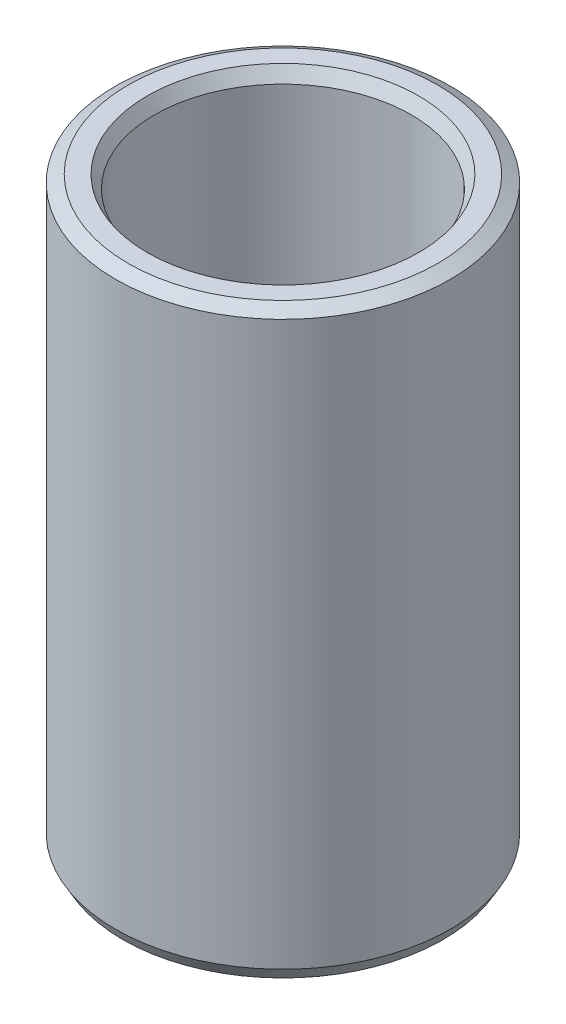
ISO-10303-21;
HEADER;
FILE_DESCRIPTION(('STEP AP214'),'2;1');
FILE_NAME('part.step','',(''),(''),'','','');
FILE_SCHEMA(('AUTOMOTIVE_DESIGN { 1 0 10303 214 1 1 1 1 }'));
ENDSEC;
DATA;
#1=APPLICATION_CONTEXT('core data for automotive mechanical design processes');
#2=APPLICATION_PROTOCOL_DEFINITION('international standard','automotive_design',2000,#1);
#3=PRODUCT_CONTEXT('',#1,'mechanical');
#4=PRODUCT('Part','Part','',(#3));
#5=PRODUCT_RELATED_PRODUCT_CATEGORY('part','',(#4));
#6=PRODUCT_DEFINITION_FORMATION('','',#4);
#7=PRODUCT_DEFINITION_CONTEXT('part definition',#1,'design');
#8=PRODUCT_DEFINITION('design','',#6,#7);
#9=PRODUCT_DEFINITION_SHAPE('','',#8);
#10=(LENGTH_UNIT() NAMED_UNIT(*) SI_UNIT(.MILLI.,.METRE.));
#11=(NAMED_UNIT(*) PLANE_ANGLE_UNIT() SI_UNIT($,.RADIAN.));
#12=(NAMED_UNIT(*) SI_UNIT($,.STERADIAN.) SOLID_ANGLE_UNIT());
#13=UNCERTAINTY_MEASURE_WITH_UNIT(LENGTH_MEASURE(1.E-05),#10,'distance_accuracy_value','');
#14=(GEOMETRIC_REPRESENTATION_CONTEXT(3) GLOBAL_UNCERTAINTY_ASSIGNED_CONTEXT((#13)) GLOBAL_UNIT_ASSIGNED_CONTEXT((#10,
#11,#12)) REPRESENTATION_CONTEXT('',''));
#15=CARTESIAN_POINT('',(0.,0.,0.));
#16=DIRECTION('',(0.,0.,1.));
#17=DIRECTION('',(1.,0.,0.));
#18=AXIS2_PLACEMENT_3D('',#15,#16,#17);
#19=CARTESIAN_POINT('',(0.,95.7550724607052,0.));
#20=DIRECTION('',(0.,-1.,0.));
#21=DIRECTION('',(0.,0.,-1.));
#22=AXIS2_PLACEMENT_3D('',#19,#20,#21);
#23=CYLINDRICAL_SURFACE('',#22,27.5);
#24=CARTESIAN_POINT('',(0.,2.09204055086404,0.));
#25=DIRECTION('',(0.,1.,0.));
#26=DIRECTION('',(0.,0.,1.));
#27=AXIS2_PLACEMENT_3D('',#24,#25,#26);
#28=CIRCLE('',#27,27.5);
#29=CARTESIAN_POINT('',(0.,2.09204055086404,27.5));
#30=VERTEX_POINT('',#29);
#31=EDGE_CURVE('E10',#30,#30,#28,.T.);
#32=ORIENTED_EDGE('',*,*,#31,.T.);
#33=EDGE_LOOP('',(#32));
#34=FACE_BOUND('',#33,.T.);
#35=CARTESIAN_POINT('',(0.,94.5472322855082,0.));
#36=DIRECTION('',(0.,1.,0.));
#37=DIRECTION('',(0.,0.,1.));
#38=AXIS2_PLACEMENT_3D('',#35,#36,#37);
#39=CIRCLE('',#38,27.5);
#40=CARTESIAN_POINT('',(0.,94.5472322855082,27.5));
#41=VERTEX_POINT('',#40);
#42=EDGE_CURVE('E50',#41,#41,#39,.F.);
#43=ORIENTED_EDGE('',*,*,#42,.T.);
#44=EDGE_LOOP('',(#43));
#45=FACE_BOUND('',#44,.T.);
#46=ADVANCED_FACE('F39',(#34,#45),#23,.T.);
#47=CARTESIAN_POINT('',(0.,95.7550724607052,0.));
#48=DIRECTION('',(0.,1.,0.));
#49=DIRECTION('',(0.,0.,1.));
#50=AXIS2_PLACEMENT_3D('',#47,#48,#49);
#51=PLANE('',#50);
#52=CARTESIAN_POINT('',(0.,95.7550724607052,0.));
#53=DIRECTION('',(0.,1.,0.));
#54=DIRECTION('',(0.,0.,1.));
#55=AXIS2_PLACEMENT_3D('',#52,#53,#54);
#56=CIRCLE('',#55,22.2969305904328);
#57=CARTESIAN_POINT('',(0.,95.7550724607052,22.2969305904328));
#58=VERTEX_POINT('',#57);
#59=EDGE_CURVE('E58',#58,#58,#56,.F.);
#60=ORIENTED_EDGE('',*,*,#59,.T.);
#61=EDGE_LOOP('',(#60));
#62=FACE_BOUND('',#61,.T.);
#63=CARTESIAN_POINT('',(0.,95.7550724607052,0.));
#64=DIRECTION('',(0.,1.,0.));
#65=DIRECTION('',(0.,0.,1.));
#66=AXIS2_PLACEMENT_3D('',#63,#64,#65);
#67=CIRCLE('',#66,25.4079594491359);
#68=CARTESIAN_POINT('',(0.,95.7550724607052,25.4079594491359));
#69=VERTEX_POINT('',#68);
#70=EDGE_CURVE('E61',#69,#69,#67,.T.);
#71=ORIENTED_EDGE('',*,*,#70,.T.);
#72=EDGE_LOOP('',(#71));
#73=FACE_BOUND('',#72,.T.);
#74=ADVANCED_FACE('F88',(#62,#73),#51,.T.);
#75=CARTESIAN_POINT('',(0.,0.,0.));
#76=DIRECTION('',(0.,1.,0.));
#77=DIRECTION('',(0.,0.,1.));
#78=AXIS2_PLACEMENT_3D('',#75,#76,#77);
#79=PLANE('',#78);
#80=CARTESIAN_POINT('',(0.,0.,0.));
#81=DIRECTION('',(0.,1.,0.));
#82=DIRECTION('',(0.,0.,1.));
#83=AXIS2_PLACEMENT_3D('',#80,#81,#82);
#84=CIRCLE('',#83,23.1811309660998);
#85=CARTESIAN_POINT('',(0.,0.,23.1811309660998));
#86=VERTEX_POINT('',#85);
#87=EDGE_CURVE('E51',#86,#86,#84,.T.);
#88=ORIENTED_EDGE('',*,*,#87,.T.);
#89=EDGE_LOOP('',(#88));
#90=FACE_BOUND('',#89,.T.);
#91=CARTESIAN_POINT('',(0.,0.,0.));
#92=DIRECTION('',(0.,1.,0.));
#93=DIRECTION('',(0.,0.,1.));
#94=AXIS2_PLACEMENT_3D('',#91,#92,#93);
#95=CIRCLE('',#94,26.292159824803);
#96=CARTESIAN_POINT('',(0.,0.,26.292159824803));
#97=VERTEX_POINT('',#96);
#98=EDGE_CURVE('E54',#97,#97,#95,.F.);
#99=ORIENTED_EDGE('',*,*,#98,.T.);
#100=EDGE_LOOP('',(#99));
#101=FACE_BOUND('',#100,.T.);
#102=ADVANCED_FACE('F83',(#90,#101),#79,.F.);
#103=CARTESIAN_POINT('',(0.,95.7550724607052,0.));
#104=DIRECTION('',(0.,-1.,0.));
#105=DIRECTION('',(0.,0.,-1.));
#106=AXIS2_PLACEMENT_3D('',#103,#104,#105);
#107=CYLINDRICAL_SURFACE('',#106,21.0890904152358);
#108=CARTESIAN_POINT('',(0.,93.6630319098412,0.));
#109=DIRECTION('',(0.,1.,0.));
#110=DIRECTION('',(0.,0.,1.));
#111=AXIS2_PLACEMENT_3D('',#108,#109,#110);
#112=CIRCLE('',#111,21.0890904152358);
#113=CARTESIAN_POINT('',(0.,93.6630319098412,21.0890904152358));
#114=VERTEX_POINT('',#113);
#115=EDGE_CURVE('E67',#114,#114,#112,.T.);
#116=ORIENTED_EDGE('',*,*,#115,.T.);
#117=EDGE_LOOP('',(#116));
#118=FACE_BOUND('',#117,.T.);
#119=CARTESIAN_POINT('',(0.,1.20784017519697,0.));
#120=DIRECTION('',(0.,1.,0.));
#121=DIRECTION('',(0.,0.,1.));
#122=AXIS2_PLACEMENT_3D('',#119,#120,#121);
#123=CIRCLE('',#122,21.0890904152358);
#124=CARTESIAN_POINT('',(0.,1.20784017519697,21.0890904152358));
#125=VERTEX_POINT('',#124);
#126=EDGE_CURVE('E69',#125,#125,#123,.F.);
#127=ORIENTED_EDGE('',*,*,#126,.T.);
#128=EDGE_LOOP('',(#127));
#129=FACE_BOUND('',#128,.T.);
#130=ADVANCED_FACE('F71',(#118,#129),#107,.F.);
#131=CARTESIAN_POINT('',(0.,93.6630319098412,0.));
#132=DIRECTION('',(0.,1.,0.));
#133=DIRECTION('',(0.,0.,1.));
#134=AXIS2_PLACEMENT_3D('',#131,#132,#133);
#135=CONICAL_SURFACE('',#134,21.0890904152358,0.523598775598295);
#136=ORIENTED_EDGE('',*,*,#59,.F.);
#137=EDGE_LOOP('',(#136));
#138=FACE_BOUND('',#137,.T.);
#139=ORIENTED_EDGE('',*,*,#115,.F.);
#140=EDGE_LOOP('',(#139));
#141=FACE_BOUND('',#140,.T.);
#142=ADVANCED_FACE('F77',(#138,#141),#135,.F.);
#143=CARTESIAN_POINT('',(0.,0.,0.));
#144=DIRECTION('',(0.,-1.,0.));
#145=DIRECTION('',(0.,0.,-1.));
#146=AXIS2_PLACEMENT_3D('',#143,#144,#145);
#147=CONICAL_SURFACE('',#146,23.1811309660998,1.0471975511966);
#148=ORIENTED_EDGE('',*,*,#126,.F.);
#149=EDGE_LOOP('',(#148));
#150=FACE_BOUND('',#149,.T.);
#151=ORIENTED_EDGE('',*,*,#87,.F.);
#152=EDGE_LOOP('',(#151));
#153=FACE_BOUND('',#152,.T.);
#154=ADVANCED_FACE('F73',(#150,#153),#147,.F.);
#155=CARTESIAN_POINT('',(0.,2.09204055086404,0.));
#156=DIRECTION('',(0.,1.,0.));
#157=DIRECTION('',(0.,0.,1.));
#158=AXIS2_PLACEMENT_3D('',#155,#156,#157);
#159=CONICAL_SURFACE('',#158,27.5,0.523598775598302);
#160=ORIENTED_EDGE('',*,*,#98,.F.);
#161=EDGE_LOOP('',(#160));
#162=FACE_BOUND('',#161,.T.);
#163=ORIENTED_EDGE('',*,*,#31,.F.);
#164=EDGE_LOOP('',(#163));
#165=FACE_BOUND('',#164,.T.);
#166=ADVANCED_FACE('F76',(#162,#165),#159,.T.);
#167=CARTESIAN_POINT('',(0.,95.7550724607052,0.));
#168=DIRECTION('',(0.,-1.,0.));
#169=DIRECTION('',(0.,0.,-1.));
#170=AXIS2_PLACEMENT_3D('',#167,#168,#169);
#171=CONICAL_SURFACE('',#170,25.4079594491359,1.0471975511966);
#172=ORIENTED_EDGE('',*,*,#42,.F.);
#173=EDGE_LOOP('',(#172));
#174=FACE_BOUND('',#173,.T.);
#175=ORIENTED_EDGE('',*,*,#70,.F.);
#176=EDGE_LOOP('',(#175));
#177=FACE_BOUND('',#176,.T.);
#178=ADVANCED_FACE('F45',(#174,#177),#171,.T.);
#179=CLOSED_SHELL('',(#46,#74,#102,#130,#142,#154,#166,#178));
#180=MANIFOLD_SOLID_BREP('B2',#179);
#181=ADVANCED_BREP_SHAPE_REPRESENTATION('',(#18,#180),#14);
#182=SHAPE_DEFINITION_REPRESENTATION(#9,#181);
ENDSEC;
END-ISO-10303-21;
